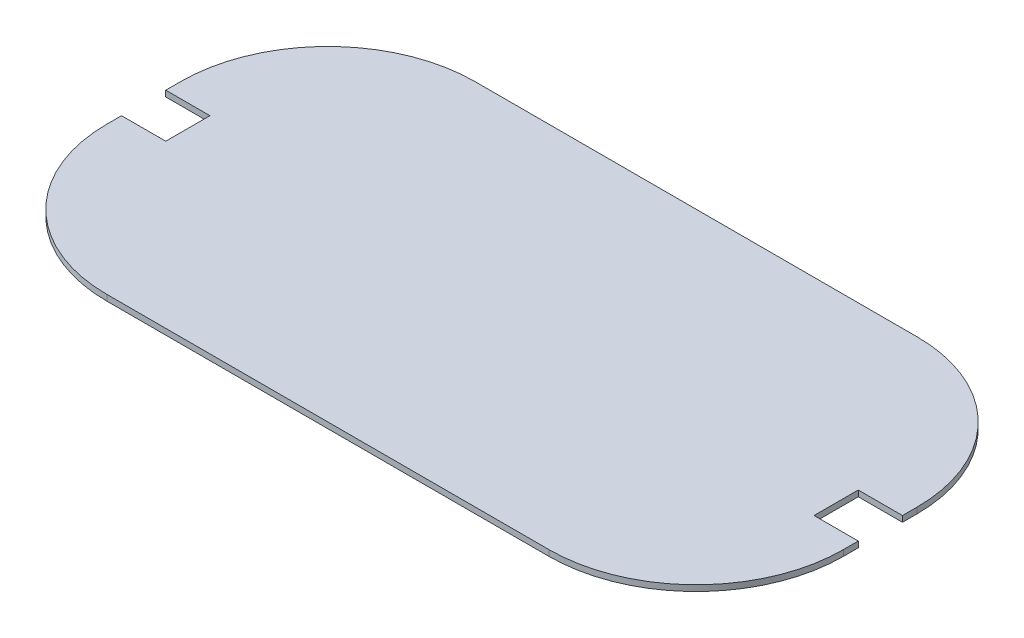
ISO-10303-21;
HEADER;
FILE_DESCRIPTION(('STEP AP214'),'2;1');
FILE_NAME('part.step','',(''),(''),'','','');
FILE_SCHEMA(('AUTOMOTIVE_DESIGN { 1 0 10303 214 1 1 1 1 }'));
ENDSEC;
DATA;
#1=APPLICATION_CONTEXT('core data for automotive mechanical design processes');
#2=APPLICATION_PROTOCOL_DEFINITION('international standard','automotive_design',2000,#1);
#3=PRODUCT_CONTEXT('',#1,'mechanical');
#4=PRODUCT('Part','Part','',(#3));
#5=PRODUCT_RELATED_PRODUCT_CATEGORY('part','',(#4));
#6=PRODUCT_DEFINITION_FORMATION('','',#4);
#7=PRODUCT_DEFINITION_CONTEXT('part definition',#1,'design');
#8=PRODUCT_DEFINITION('design','',#6,#7);
#9=PRODUCT_DEFINITION_SHAPE('','',#8);
#10=(LENGTH_UNIT() NAMED_UNIT(*) SI_UNIT(.MILLI.,.METRE.));
#11=(NAMED_UNIT(*) PLANE_ANGLE_UNIT() SI_UNIT($,.RADIAN.));
#12=(NAMED_UNIT(*) SI_UNIT($,.STERADIAN.) SOLID_ANGLE_UNIT());
#13=UNCERTAINTY_MEASURE_WITH_UNIT(LENGTH_MEASURE(1.E-05),#10,'distance_accuracy_value','');
#14=(GEOMETRIC_REPRESENTATION_CONTEXT(3) GLOBAL_UNCERTAINTY_ASSIGNED_CONTEXT((#13)) GLOBAL_UNIT_ASSIGNED_CONTEXT((#10,
#11,#12)) REPRESENTATION_CONTEXT('',''));
#15=CARTESIAN_POINT('',(0.,0.,0.));
#16=DIRECTION('',(0.,0.,1.));
#17=DIRECTION('',(1.,0.,0.));
#18=AXIS2_PLACEMENT_3D('',#15,#16,#17);
#19=CARTESIAN_POINT('',(250.,4.,125.));
#20=DIRECTION('',(-1.,0.,0.));
#21=DIRECTION('',(0.,0.,1.));
#22=AXIS2_PLACEMENT_3D('',#19,#20,#21);
#23=PLANE('',#22);
#24=DIRECTION('',(0.,0.,-1.));
#25=VECTOR('',#24,1.);
#26=CARTESIAN_POINT('',(250.,4.,125.));
#27=LINE('',#26,#25);
#28=CARTESIAN_POINT('',(250.,4.,-15.));
#29=VERTEX_POINT('',#28);
#30=CARTESIAN_POINT('',(250.,4.,-25.));
#31=VERTEX_POINT('',#30);
#32=EDGE_CURVE('E171',#29,#31,#27,.T.);
#33=ORIENTED_EDGE('',*,*,#32,.F.);
#34=DIRECTION('',(0.,-1.,0.));
#35=VECTOR('',#34,1.);
#36=CARTESIAN_POINT('',(250.,10.,-15.));
#37=LINE('',#36,#35);
#38=CARTESIAN_POINT('',(250.,0.,-15.));
#39=VERTEX_POINT('',#38);
#40=EDGE_CURVE('E156',#29,#39,#37,.T.);
#41=ORIENTED_EDGE('',*,*,#40,.T.);
#42=DIRECTION('',(0.,0.,-1.));
#43=VECTOR('',#42,1.);
#44=CARTESIAN_POINT('',(250.,0.,125.));
#45=LINE('',#44,#43);
#46=CARTESIAN_POINT('',(250.,0.,-25.));
#47=VERTEX_POINT('',#46);
#48=EDGE_CURVE('E169',#39,#47,#45,.T.);
#49=ORIENTED_EDGE('',*,*,#48,.T.);
#50=DIRECTION('',(0.,-1.,0.));
#51=VECTOR('',#50,1.);
#52=CARTESIAN_POINT('',(250.,4.,-25.));
#53=LINE('',#52,#51);
#54=EDGE_CURVE('E198',#47,#31,#53,.F.);
#55=ORIENTED_EDGE('',*,*,#54,.T.);
#56=EDGE_LOOP('',(#33,#41,#49,#55));
#57=FACE_BOUND('',#56,.T.);
#58=ADVANCED_FACE('F39',(#57),#23,.F.);
#59=CARTESIAN_POINT('',(-250.,4.,125.));
#60=DIRECTION('',(1.,0.,0.));
#61=DIRECTION('',(0.,0.,-1.));
#62=AXIS2_PLACEMENT_3D('',#59,#60,#61);
#63=PLANE('',#62);
#64=DIRECTION('',(0.,-1.,0.));
#65=VECTOR('',#64,1.);
#66=CARTESIAN_POINT('',(-250.,10.,-15.));
#67=LINE('',#66,#65);
#68=CARTESIAN_POINT('',(-250.,4.,-15.));
#69=VERTEX_POINT('',#68);
#70=CARTESIAN_POINT('',(-250.,0.,-15.));
#71=VERTEX_POINT('',#70);
#72=EDGE_CURVE('E284',#69,#71,#67,.T.);
#73=ORIENTED_EDGE('',*,*,#72,.F.);
#74=DIRECTION('',(0.,0.,1.));
#75=VECTOR('',#74,1.);
#76=CARTESIAN_POINT('',(-250.,4.,125.));
#77=LINE('',#76,#75);
#78=CARTESIAN_POINT('',(-250.,4.,-25.));
#79=VERTEX_POINT('',#78);
#80=EDGE_CURVE('E250',#79,#69,#77,.T.);
#81=ORIENTED_EDGE('',*,*,#80,.F.);
#82=DIRECTION('',(0.,-1.,0.));
#83=VECTOR('',#82,1.);
#84=CARTESIAN_POINT('',(-250.,4.,-25.));
#85=LINE('',#84,#83);
#86=CARTESIAN_POINT('',(-250.,0.,-25.));
#87=VERTEX_POINT('',#86);
#88=EDGE_CURVE('E11',#79,#87,#85,.T.);
#89=ORIENTED_EDGE('',*,*,#88,.T.);
#90=DIRECTION('',(0.,0.,1.));
#91=VECTOR('',#90,1.);
#92=CARTESIAN_POINT('',(-250.,0.,125.));
#93=LINE('',#92,#91);
#94=EDGE_CURVE('E192',#87,#71,#93,.T.);
#95=ORIENTED_EDGE('',*,*,#94,.T.);
#96=EDGE_LOOP('',(#73,#81,#89,#95));
#97=FACE_BOUND('',#96,.T.);
#98=ADVANCED_FACE('F317',(#97),#63,.F.);
#99=DIRECTION('',(0.,-1.,0.));
#100=VECTOR('',#99,1.);
#101=CARTESIAN_POINT('',(-250.,10.,15.));
#102=LINE('',#101,#100);
#103=CARTESIAN_POINT('',(-250.,4.,15.));
#104=VERTEX_POINT('',#103);
#105=CARTESIAN_POINT('',(-250.,0.,15.));
#106=VERTEX_POINT('',#105);
#107=EDGE_CURVE('E282',#104,#106,#102,.T.);
#108=ORIENTED_EDGE('',*,*,#107,.T.);
#109=CARTESIAN_POINT('',(-250.,0.,25.));
#110=VERTEX_POINT('',#109);
#111=EDGE_CURVE('E191',#106,#110,#93,.T.);
#112=ORIENTED_EDGE('',*,*,#111,.T.);
#113=DIRECTION('',(0.,-1.,0.));
#114=VECTOR('',#113,1.);
#115=CARTESIAN_POINT('',(-250.,4.,25.));
#116=LINE('',#115,#114);
#117=CARTESIAN_POINT('',(-250.,4.,25.));
#118=VERTEX_POINT('',#117);
#119=EDGE_CURVE('E47',#110,#118,#116,.F.);
#120=ORIENTED_EDGE('',*,*,#119,.T.);
#121=EDGE_CURVE('E235',#104,#118,#77,.T.);
#122=ORIENTED_EDGE('',*,*,#121,.F.);
#123=EDGE_LOOP('',(#108,#112,#120,#122));
#124=FACE_BOUND('',#123,.T.);
#125=ADVANCED_FACE('F234',(#124),#63,.F.);
#126=CARTESIAN_POINT('',(0.,4.,0.));
#127=DIRECTION('',(0.,-1.,0.));
#128=DIRECTION('',(0.,0.,-1.));
#129=AXIS2_PLACEMENT_3D('',#126,#127,#128);
#130=PLANE('',#129);
#131=DIRECTION('',(0.,0.,-1.));
#132=VECTOR('',#131,1.);
#133=CARTESIAN_POINT('',(220.,4.,0.));
#134=LINE('',#133,#132);
#135=CARTESIAN_POINT('',(220.,4.,15.));
#136=VERTEX_POINT('',#135);
#137=CARTESIAN_POINT('',(220.,4.,-15.));
#138=VERTEX_POINT('',#137);
#139=EDGE_CURVE('E183',#136,#138,#134,.T.);
#140=ORIENTED_EDGE('',*,*,#139,.T.);
#141=DIRECTION('',(1.,0.,0.));
#142=VECTOR('',#141,1.);
#143=CARTESIAN_POINT('',(0.,4.,-15.));
#144=LINE('',#143,#142);
#145=EDGE_CURVE('E179',#138,#29,#144,.T.);
#146=ORIENTED_EDGE('',*,*,#145,.T.);
#147=ORIENTED_EDGE('',*,*,#32,.T.);
#148=CARTESIAN_POINT('',(150.,4.,-25.));
#149=DIRECTION('',(0.,-1.,0.));
#150=DIRECTION('',(0.,0.,-1.));
#151=AXIS2_PLACEMENT_3D('',#148,#149,#150);
#152=CIRCLE('',#151,100.);
#153=CARTESIAN_POINT('',(150.,4.,-125.));
#154=VERTEX_POINT('',#153);
#155=EDGE_CURVE('E220',#31,#154,#152,.F.);
#156=ORIENTED_EDGE('',*,*,#155,.T.);
#157=DIRECTION('',(-1.,0.,0.));
#158=VECTOR('',#157,1.);
#159=CARTESIAN_POINT('',(-250.,4.,-125.));
#160=LINE('',#159,#158);
#161=CARTESIAN_POINT('',(-150.,4.,-125.));
#162=VERTEX_POINT('',#161);
#163=EDGE_CURVE('E254',#154,#162,#160,.T.);
#164=ORIENTED_EDGE('',*,*,#163,.T.);
#165=CARTESIAN_POINT('',(-150.,4.,-25.));
#166=DIRECTION('',(0.,-1.,0.));
#167=DIRECTION('',(0.,0.,-1.));
#168=AXIS2_PLACEMENT_3D('',#165,#166,#167);
#169=CIRCLE('',#168,100.);
#170=EDGE_CURVE('E218',#162,#79,#169,.F.);
#171=ORIENTED_EDGE('',*,*,#170,.T.);
#172=ORIENTED_EDGE('',*,*,#80,.T.);
#173=DIRECTION('',(-1.,0.,0.));
#174=VECTOR('',#173,1.);
#175=CARTESIAN_POINT('',(0.,4.,-15.));
#176=LINE('',#175,#174);
#177=CARTESIAN_POINT('',(-220.,4.,-15.));
#178=VERTEX_POINT('',#177);
#179=EDGE_CURVE('E265',#178,#69,#176,.T.);
#180=ORIENTED_EDGE('',*,*,#179,.F.);
#181=DIRECTION('',(0.,0.,-1.));
#182=VECTOR('',#181,1.);
#183=CARTESIAN_POINT('',(-220.,4.,0.));
#184=LINE('',#183,#182);
#185=CARTESIAN_POINT('',(-220.,4.,15.));
#186=VERTEX_POINT('',#185);
#187=EDGE_CURVE('E269',#186,#178,#184,.T.);
#188=ORIENTED_EDGE('',*,*,#187,.F.);
#189=DIRECTION('',(1.,0.,0.));
#190=VECTOR('',#189,1.);
#191=CARTESIAN_POINT('',(0.,4.,15.));
#192=LINE('',#191,#190);
#193=EDGE_CURVE('E267',#104,#186,#192,.T.);
#194=ORIENTED_EDGE('',*,*,#193,.F.);
#195=ORIENTED_EDGE('',*,*,#121,.T.);
#196=CARTESIAN_POINT('',(-150.,4.,25.));
#197=DIRECTION('',(0.,-1.,0.));
#198=DIRECTION('',(0.,0.,-1.));
#199=AXIS2_PLACEMENT_3D('',#196,#197,#198);
#200=CIRCLE('',#199,100.);
#201=CARTESIAN_POINT('',(-150.,4.,125.));
#202=VERTEX_POINT('',#201);
#203=EDGE_CURVE('E216',#118,#202,#200,.F.);
#204=ORIENTED_EDGE('',*,*,#203,.T.);
#205=DIRECTION('',(1.,0.,0.));
#206=VECTOR('',#205,1.);
#207=CARTESIAN_POINT('',(-250.,4.,125.));
#208=LINE('',#207,#206);
#209=CARTESIAN_POINT('',(150.,4.,125.));
#210=VERTEX_POINT('',#209);
#211=EDGE_CURVE('E187',#202,#210,#208,.T.);
#212=ORIENTED_EDGE('',*,*,#211,.T.);
#213=CARTESIAN_POINT('',(150.,4.,25.));
#214=DIRECTION('',(0.,-1.,0.));
#215=DIRECTION('',(0.,0.,-1.));
#216=AXIS2_PLACEMENT_3D('',#213,#214,#215);
#217=CIRCLE('',#216,100.);
#218=CARTESIAN_POINT('',(250.,4.,25.));
#219=VERTEX_POINT('',#218);
#220=EDGE_CURVE('E222',#210,#219,#217,.F.);
#221=ORIENTED_EDGE('',*,*,#220,.T.);
#222=CARTESIAN_POINT('',(250.,4.,15.));
#223=VERTEX_POINT('',#222);
#224=EDGE_CURVE('E258',#219,#223,#27,.T.);
#225=ORIENTED_EDGE('',*,*,#224,.T.);
#226=DIRECTION('',(-1.,0.,0.));
#227=VECTOR('',#226,1.);
#228=CARTESIAN_POINT('',(0.,4.,15.));
#229=LINE('',#228,#227);
#230=EDGE_CURVE('E262',#223,#136,#229,.T.);
#231=ORIENTED_EDGE('',*,*,#230,.T.);
#232=EDGE_LOOP('',(#140,#146,#147,#156,#164,#171,#172,#180,#188,#194,#195,#204,#212,#221,#225,#231));
#233=FACE_BOUND('',#232,.T.);
#234=ADVANCED_FACE('F243',(#233),#130,.F.);
#235=CARTESIAN_POINT('',(0.,0.,0.));
#236=DIRECTION('',(0.,-1.,0.));
#237=DIRECTION('',(0.,0.,-1.));
#238=AXIS2_PLACEMENT_3D('',#235,#236,#237);
#239=PLANE('',#238);
#240=DIRECTION('',(1.,0.,0.));
#241=VECTOR('',#240,1.);
#242=CARTESIAN_POINT('',(220.,0.,-15.));
#243=LINE('',#242,#241);
#244=CARTESIAN_POINT('',(220.,0.,-15.));
#245=VERTEX_POINT('',#244);
#246=EDGE_CURVE('E153',#245,#39,#243,.T.);
#247=ORIENTED_EDGE('',*,*,#246,.F.);
#248=DIRECTION('',(0.,0.,-1.));
#249=VECTOR('',#248,1.);
#250=CARTESIAN_POINT('',(220.,0.,15.));
#251=LINE('',#250,#249);
#252=CARTESIAN_POINT('',(220.,0.,15.));
#253=VERTEX_POINT('',#252);
#254=EDGE_CURVE('E172',#253,#245,#251,.T.);
#255=ORIENTED_EDGE('',*,*,#254,.F.);
#256=DIRECTION('',(-1.,0.,0.));
#257=VECTOR('',#256,1.);
#258=CARTESIAN_POINT('',(250.,0.,15.));
#259=LINE('',#258,#257);
#260=CARTESIAN_POINT('',(250.,0.,15.));
#261=VERTEX_POINT('',#260);
#262=EDGE_CURVE('E164',#261,#253,#259,.T.);
#263=ORIENTED_EDGE('',*,*,#262,.F.);
#264=CARTESIAN_POINT('',(250.,0.,25.));
#265=VERTEX_POINT('',#264);
#266=EDGE_CURVE('E178',#265,#261,#45,.T.);
#267=ORIENTED_EDGE('',*,*,#266,.F.);
#268=CARTESIAN_POINT('',(150.,0.,25.));
#269=DIRECTION('',(0.,-1.,0.));
#270=DIRECTION('',(0.,0.,-1.));
#271=AXIS2_PLACEMENT_3D('',#268,#269,#270);
#272=CIRCLE('',#271,100.);
#273=CARTESIAN_POINT('',(150.,0.,125.));
#274=VERTEX_POINT('',#273);
#275=EDGE_CURVE('E209',#265,#274,#272,.T.);
#276=ORIENTED_EDGE('',*,*,#275,.T.);
#277=DIRECTION('',(1.,0.,0.));
#278=VECTOR('',#277,1.);
#279=CARTESIAN_POINT('',(-250.,0.,125.));
#280=LINE('',#279,#278);
#281=CARTESIAN_POINT('',(-150.,0.,125.));
#282=VERTEX_POINT('',#281);
#283=EDGE_CURVE('E195',#282,#274,#280,.T.);
#284=ORIENTED_EDGE('',*,*,#283,.F.);
#285=CARTESIAN_POINT('',(-150.,0.,25.));
#286=DIRECTION('',(0.,-1.,0.));
#287=DIRECTION('',(0.,0.,-1.));
#288=AXIS2_PLACEMENT_3D('',#285,#286,#287);
#289=CIRCLE('',#288,100.);
#290=EDGE_CURVE('E203',#282,#110,#289,.T.);
#291=ORIENTED_EDGE('',*,*,#290,.T.);
#292=ORIENTED_EDGE('',*,*,#111,.F.);
#293=DIRECTION('',(1.,0.,0.));
#294=VECTOR('',#293,1.);
#295=CARTESIAN_POINT('',(-250.,0.,15.));
#296=LINE('',#295,#294);
#297=CARTESIAN_POINT('',(-220.,0.,15.));
#298=VERTEX_POINT('',#297);
#299=EDGE_CURVE('E272',#106,#298,#296,.T.);
#300=ORIENTED_EDGE('',*,*,#299,.T.);
#301=DIRECTION('',(0.,0.,-1.));
#302=VECTOR('',#301,1.);
#303=CARTESIAN_POINT('',(-220.,0.,15.));
#304=LINE('',#303,#302);
#305=CARTESIAN_POINT('',(-220.,0.,-15.));
#306=VERTEX_POINT('',#305);
#307=EDGE_CURVE('E275',#298,#306,#304,.T.);
#308=ORIENTED_EDGE('',*,*,#307,.T.);
#309=DIRECTION('',(-1.,0.,0.));
#310=VECTOR('',#309,1.);
#311=CARTESIAN_POINT('',(-220.,0.,-15.));
#312=LINE('',#311,#310);
#313=EDGE_CURVE('E54',#306,#71,#312,.T.);
#314=ORIENTED_EDGE('',*,*,#313,.T.);
#315=ORIENTED_EDGE('',*,*,#94,.F.);
#316=CARTESIAN_POINT('',(-150.,0.,-25.));
#317=DIRECTION('',(0.,-1.,0.));
#318=DIRECTION('',(0.,0.,-1.));
#319=AXIS2_PLACEMENT_3D('',#316,#317,#318);
#320=CIRCLE('',#319,100.);
#321=CARTESIAN_POINT('',(-150.,0.,-125.));
#322=VERTEX_POINT('',#321);
#323=EDGE_CURVE('E206',#87,#322,#320,.T.);
#324=ORIENTED_EDGE('',*,*,#323,.T.);
#325=DIRECTION('',(-1.,0.,0.));
#326=VECTOR('',#325,1.);
#327=CARTESIAN_POINT('',(-250.,0.,-125.));
#328=LINE('',#327,#326);
#329=CARTESIAN_POINT('',(150.,0.,-125.));
#330=VERTEX_POINT('',#329);
#331=EDGE_CURVE('E182',#330,#322,#328,.T.);
#332=ORIENTED_EDGE('',*,*,#331,.F.);
#333=CARTESIAN_POINT('',(150.,0.,-25.));
#334=DIRECTION('',(0.,-1.,0.));
#335=DIRECTION('',(0.,0.,-1.));
#336=AXIS2_PLACEMENT_3D('',#333,#334,#335);
#337=CIRCLE('',#336,100.);
#338=EDGE_CURVE('E176',#330,#47,#337,.T.);
#339=ORIENTED_EDGE('',*,*,#338,.T.);
#340=ORIENTED_EDGE('',*,*,#48,.F.);
#341=EDGE_LOOP('',(#247,#255,#263,#267,#276,#284,#291,#292,#300,#308,#314,#315,#324,#332,#339,#340));
#342=FACE_BOUND('',#341,.T.);
#343=ADVANCED_FACE('F174',(#342),#239,.T.);
#344=ORIENTED_EDGE('',*,*,#266,.T.);
#345=DIRECTION('',(0.,-1.,0.));
#346=VECTOR('',#345,1.);
#347=CARTESIAN_POINT('',(250.,10.,15.));
#348=LINE('',#347,#346);
#349=EDGE_CURVE('E62',#223,#261,#348,.T.);
#350=ORIENTED_EDGE('',*,*,#349,.F.);
#351=ORIENTED_EDGE('',*,*,#224,.F.);
#352=DIRECTION('',(0.,-1.,0.));
#353=VECTOR('',#352,1.);
#354=CARTESIAN_POINT('',(250.,4.,25.));
#355=LINE('',#354,#353);
#356=EDGE_CURVE('E200',#219,#265,#355,.T.);
#357=ORIENTED_EDGE('',*,*,#356,.T.);
#358=EDGE_LOOP('',(#344,#350,#351,#357));
#359=FACE_BOUND('',#358,.T.);
#360=ADVANCED_FACE('F298',(#359),#23,.F.);
#361=CARTESIAN_POINT('',(-250.,4.,-125.));
#362=DIRECTION('',(0.,0.,1.));
#363=DIRECTION('',(1.,0.,0.));
#364=AXIS2_PLACEMENT_3D('',#361,#362,#363);
#365=PLANE('',#364);
#366=ORIENTED_EDGE('',*,*,#163,.F.);
#367=DIRECTION('',(0.,-1.,0.));
#368=VECTOR('',#367,1.);
#369=CARTESIAN_POINT('',(150.,4.,-125.));
#370=LINE('',#369,#368);
#371=EDGE_CURVE('E226',#154,#330,#370,.T.);
#372=ORIENTED_EDGE('',*,*,#371,.T.);
#373=ORIENTED_EDGE('',*,*,#331,.T.);
#374=DIRECTION('',(0.,-1.,0.));
#375=VECTOR('',#374,1.);
#376=CARTESIAN_POINT('',(-150.,4.,-125.));
#377=LINE('',#376,#375);
#378=EDGE_CURVE('E224',#322,#162,#377,.F.);
#379=ORIENTED_EDGE('',*,*,#378,.T.);
#380=EDGE_LOOP('',(#366,#372,#373,#379));
#381=FACE_BOUND('',#380,.T.);
#382=ADVANCED_FACE('F313',(#381),#365,.F.);
#383=CARTESIAN_POINT('',(-250.,4.,125.));
#384=DIRECTION('',(0.,0.,-1.));
#385=DIRECTION('',(-1.,0.,0.));
#386=AXIS2_PLACEMENT_3D('',#383,#384,#385);
#387=PLANE('',#386);
#388=ORIENTED_EDGE('',*,*,#283,.T.);
#389=DIRECTION('',(0.,-1.,0.));
#390=VECTOR('',#389,1.);
#391=CARTESIAN_POINT('',(150.,4.,125.));
#392=LINE('',#391,#390);
#393=EDGE_CURVE('E214',#274,#210,#392,.F.);
#394=ORIENTED_EDGE('',*,*,#393,.T.);
#395=ORIENTED_EDGE('',*,*,#211,.F.);
#396=DIRECTION('',(0.,-1.,0.));
#397=VECTOR('',#396,1.);
#398=CARTESIAN_POINT('',(-150.,4.,125.));
#399=LINE('',#398,#397);
#400=EDGE_CURVE('E211',#202,#282,#399,.T.);
#401=ORIENTED_EDGE('',*,*,#400,.T.);
#402=EDGE_LOOP('',(#388,#394,#395,#401));
#403=FACE_BOUND('',#402,.T.);
#404=ADVANCED_FACE('F247',(#403),#387,.F.);
#405=CARTESIAN_POINT('',(150.,4.,25.));
#406=DIRECTION('',(0.,-1.,0.));
#407=DIRECTION('',(0.,0.,-1.));
#408=AXIS2_PLACEMENT_3D('',#405,#406,#407);
#409=CYLINDRICAL_SURFACE('',#408,100.);
#410=ORIENTED_EDGE('',*,*,#220,.F.);
#411=ORIENTED_EDGE('',*,*,#393,.F.);
#412=ORIENTED_EDGE('',*,*,#275,.F.);
#413=ORIENTED_EDGE('',*,*,#356,.F.);
#414=EDGE_LOOP('',(#410,#411,#412,#413));
#415=FACE_BOUND('',#414,.T.);
#416=ADVANCED_FACE('F301',(#415),#409,.T.);
#417=CARTESIAN_POINT('',(150.,4.,-25.));
#418=DIRECTION('',(0.,-1.,0.));
#419=DIRECTION('',(0.,0.,-1.));
#420=AXIS2_PLACEMENT_3D('',#417,#418,#419);
#421=CYLINDRICAL_SURFACE('',#420,100.);
#422=ORIENTED_EDGE('',*,*,#155,.F.);
#423=ORIENTED_EDGE('',*,*,#54,.F.);
#424=ORIENTED_EDGE('',*,*,#338,.F.);
#425=ORIENTED_EDGE('',*,*,#371,.F.);
#426=EDGE_LOOP('',(#422,#423,#424,#425));
#427=FACE_BOUND('',#426,.T.);
#428=ADVANCED_FACE('F303',(#427),#421,.T.);
#429=CARTESIAN_POINT('',(-150.,4.,-25.));
#430=DIRECTION('',(0.,-1.,0.));
#431=DIRECTION('',(0.,0.,-1.));
#432=AXIS2_PLACEMENT_3D('',#429,#430,#431);
#433=CYLINDRICAL_SURFACE('',#432,100.);
#434=ORIENTED_EDGE('',*,*,#170,.F.);
#435=ORIENTED_EDGE('',*,*,#378,.F.);
#436=ORIENTED_EDGE('',*,*,#323,.F.);
#437=ORIENTED_EDGE('',*,*,#88,.F.);
#438=EDGE_LOOP('',(#434,#435,#436,#437));
#439=FACE_BOUND('',#438,.T.);
#440=ADVANCED_FACE('F309',(#439),#433,.T.);
#441=CARTESIAN_POINT('',(-150.,4.,25.));
#442=DIRECTION('',(0.,-1.,0.));
#443=DIRECTION('',(0.,0.,-1.));
#444=AXIS2_PLACEMENT_3D('',#441,#442,#443);
#445=CYLINDRICAL_SURFACE('',#444,100.);
#446=ORIENTED_EDGE('',*,*,#203,.F.);
#447=ORIENTED_EDGE('',*,*,#119,.F.);
#448=ORIENTED_EDGE('',*,*,#290,.F.);
#449=ORIENTED_EDGE('',*,*,#400,.F.);
#450=EDGE_LOOP('',(#446,#447,#448,#449));
#451=FACE_BOUND('',#450,.T.);
#452=ADVANCED_FACE('F41',(#451),#445,.T.);
#453=CARTESIAN_POINT('',(-220.,10.,-15.));
#454=DIRECTION('',(0.,0.,1.));
#455=DIRECTION('',(1.,0.,0.));
#456=AXIS2_PLACEMENT_3D('',#453,#454,#455);
#457=PLANE('',#456);
#458=ORIENTED_EDGE('',*,*,#179,.T.);
#459=ORIENTED_EDGE('',*,*,#72,.T.);
#460=ORIENTED_EDGE('',*,*,#313,.F.);
#461=DIRECTION('',(0.,-1.,0.));
#462=VECTOR('',#461,1.);
#463=CARTESIAN_POINT('',(-220.,10.,-15.));
#464=LINE('',#463,#462);
#465=EDGE_CURVE('E278',#178,#306,#464,.T.);
#466=ORIENTED_EDGE('',*,*,#465,.F.);
#467=EDGE_LOOP('',(#458,#459,#460,#466));
#468=FACE_BOUND('',#467,.T.);
#469=ADVANCED_FACE('F345',(#468),#457,.T.);
#470=CARTESIAN_POINT('',(-250.,10.,15.));
#471=DIRECTION('',(0.,0.,-1.));
#472=DIRECTION('',(-1.,0.,0.));
#473=AXIS2_PLACEMENT_3D('',#470,#471,#472);
#474=PLANE('',#473);
#475=ORIENTED_EDGE('',*,*,#193,.T.);
#476=DIRECTION('',(0.,-1.,0.));
#477=VECTOR('',#476,1.);
#478=CARTESIAN_POINT('',(-220.,10.,15.));
#479=LINE('',#478,#477);
#480=EDGE_CURVE('E280',#186,#298,#479,.T.);
#481=ORIENTED_EDGE('',*,*,#480,.T.);
#482=ORIENTED_EDGE('',*,*,#299,.F.);
#483=ORIENTED_EDGE('',*,*,#107,.F.);
#484=EDGE_LOOP('',(#475,#481,#482,#483));
#485=FACE_BOUND('',#484,.T.);
#486=ADVANCED_FACE('F341',(#485),#474,.T.);
#487=CARTESIAN_POINT('',(-220.,10.,15.));
#488=DIRECTION('',(-1.,0.,0.));
#489=DIRECTION('',(0.,0.,1.));
#490=AXIS2_PLACEMENT_3D('',#487,#488,#489);
#491=PLANE('',#490);
#492=ORIENTED_EDGE('',*,*,#187,.T.);
#493=ORIENTED_EDGE('',*,*,#465,.T.);
#494=ORIENTED_EDGE('',*,*,#307,.F.);
#495=ORIENTED_EDGE('',*,*,#480,.F.);
#496=EDGE_LOOP('',(#492,#493,#494,#495));
#497=FACE_BOUND('',#496,.T.);
#498=ADVANCED_FACE('F338',(#497),#491,.T.);
#499=CARTESIAN_POINT('',(220.,10.,-15.));
#500=DIRECTION('',(0.,0.,-1.));
#501=DIRECTION('',(-1.,0.,0.));
#502=AXIS2_PLACEMENT_3D('',#499,#500,#501);
#503=PLANE('',#502);
#504=DIRECTION('',(0.,-1.,0.));
#505=VECTOR('',#504,1.);
#506=CARTESIAN_POINT('',(220.,10.,-15.));
#507=LINE('',#506,#505);
#508=EDGE_CURVE('E159',#138,#245,#507,.T.);
#509=ORIENTED_EDGE('',*,*,#508,.T.);
#510=ORIENTED_EDGE('',*,*,#246,.T.);
#511=ORIENTED_EDGE('',*,*,#40,.F.);
#512=ORIENTED_EDGE('',*,*,#145,.F.);
#513=EDGE_LOOP('',(#509,#510,#511,#512));
#514=FACE_BOUND('',#513,.T.);
#515=ADVANCED_FACE('F155',(#514),#503,.F.);
#516=CARTESIAN_POINT('',(220.,10.,15.));
#517=DIRECTION('',(-1.,0.,0.));
#518=DIRECTION('',(0.,0.,1.));
#519=AXIS2_PLACEMENT_3D('',#516,#517,#518);
#520=PLANE('',#519);
#521=DIRECTION('',(0.,-1.,0.));
#522=VECTOR('',#521,1.);
#523=CARTESIAN_POINT('',(220.,10.,15.));
#524=LINE('',#523,#522);
#525=EDGE_CURVE('E287',#136,#253,#524,.T.);
#526=ORIENTED_EDGE('',*,*,#525,.T.);
#527=ORIENTED_EDGE('',*,*,#254,.T.);
#528=ORIENTED_EDGE('',*,*,#508,.F.);
#529=ORIENTED_EDGE('',*,*,#139,.F.);
#530=EDGE_LOOP('',(#526,#527,#528,#529));
#531=FACE_BOUND('',#530,.T.);
#532=ADVANCED_FACE('F295',(#531),#520,.F.);
#533=CARTESIAN_POINT('',(250.,10.,15.));
#534=DIRECTION('',(0.,0.,1.));
#535=DIRECTION('',(1.,0.,0.));
#536=AXIS2_PLACEMENT_3D('',#533,#534,#535);
#537=PLANE('',#536);
#538=ORIENTED_EDGE('',*,*,#349,.T.);
#539=ORIENTED_EDGE('',*,*,#262,.T.);
#540=ORIENTED_EDGE('',*,*,#525,.F.);
#541=ORIENTED_EDGE('',*,*,#230,.F.);
#542=EDGE_LOOP('',(#538,#539,#540,#541));
#543=FACE_BOUND('',#542,.T.);
#544=ADVANCED_FACE('F292',(#543),#537,.F.);
#545=CLOSED_SHELL('',(#58,#98,#125,#234,#343,#360,#382,#404,#416,#428,#440,#452,#469,#486,#498,
#515,#532,#544));
#546=MANIFOLD_SOLID_BREP('B2',#545);
#547=ADVANCED_BREP_SHAPE_REPRESENTATION('',(#18,#546),#14);
#548=SHAPE_DEFINITION_REPRESENTATION(#9,#547);
ENDSEC;
END-ISO-10303-21;
